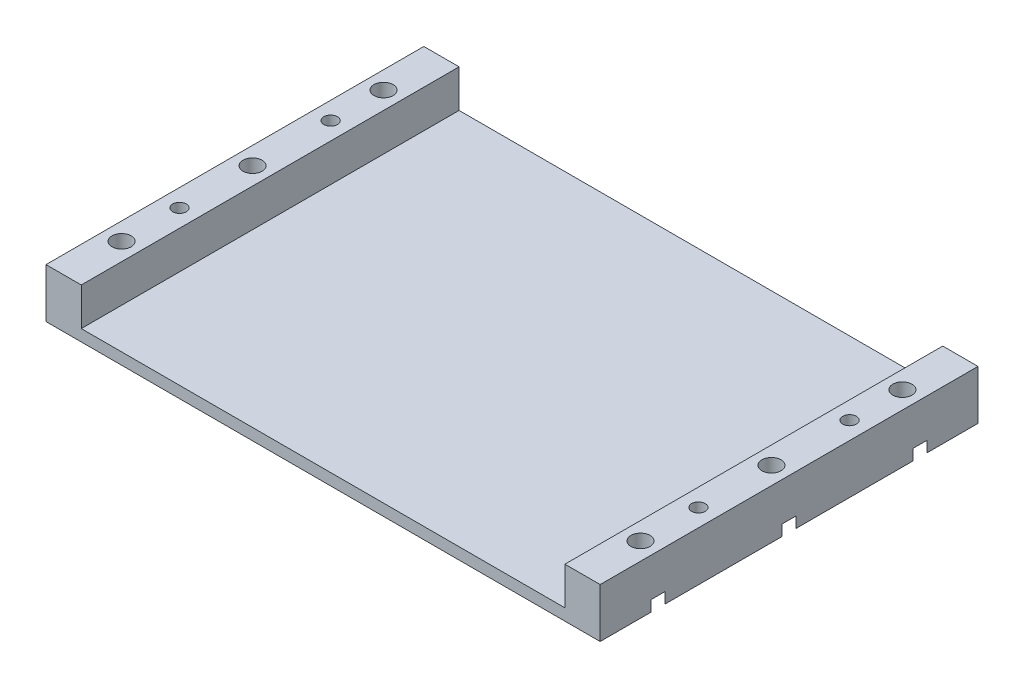
ISO-10303-21;
HEADER;
FILE_DESCRIPTION(('STEP AP214'),'2;1');
FILE_NAME('part.step','',(''),(''),'','','');
FILE_SCHEMA(('AUTOMOTIVE_DESIGN { 1 0 10303 214 1 1 1 1 }'));
ENDSEC;
DATA;
#1=APPLICATION_CONTEXT('core data for automotive mechanical design processes');
#2=APPLICATION_PROTOCOL_DEFINITION('international standard','automotive_design',2000,#1);
#3=PRODUCT_CONTEXT('',#1,'mechanical');
#4=PRODUCT('Part','Part','',(#3));
#5=PRODUCT_RELATED_PRODUCT_CATEGORY('part','',(#4));
#6=PRODUCT_DEFINITION_FORMATION('','',#4);
#7=PRODUCT_DEFINITION_CONTEXT('part definition',#1,'design');
#8=PRODUCT_DEFINITION('design','',#6,#7);
#9=PRODUCT_DEFINITION_SHAPE('','',#8);
#10=(LENGTH_UNIT() NAMED_UNIT(*) SI_UNIT(.MILLI.,.METRE.));
#11=(NAMED_UNIT(*) PLANE_ANGLE_UNIT() SI_UNIT($,.RADIAN.));
#12=(NAMED_UNIT(*) SI_UNIT($,.STERADIAN.) SOLID_ANGLE_UNIT());
#13=UNCERTAINTY_MEASURE_WITH_UNIT(LENGTH_MEASURE(1.E-05),#10,'distance_accuracy_value','');
#14=(GEOMETRIC_REPRESENTATION_CONTEXT(3) GLOBAL_UNCERTAINTY_ASSIGNED_CONTEXT((#13)) GLOBAL_UNIT_ASSIGNED_CONTEXT((#10,
#11,#12)) REPRESENTATION_CONTEXT('',''));
#15=CARTESIAN_POINT('',(0.,0.,0.));
#16=DIRECTION('',(0.,0.,1.));
#17=DIRECTION('',(1.,0.,0.));
#18=AXIS2_PLACEMENT_3D('',#15,#16,#17);
#19=CARTESIAN_POINT('',(0.,2.3,0.));
#20=DIRECTION('',(0.,0.,-1.));
#21=DIRECTION('',(-1.,0.,0.));
#22=AXIS2_PLACEMENT_3D('',#19,#20,#21);
#23=PLANE('',#22);
#24=DIRECTION('',(1.,0.,0.));
#25=VECTOR('',#24,1.);
#26=CARTESIAN_POINT('',(0.,0.,0.));
#27=LINE('',#26,#25);
#28=CARTESIAN_POINT('',(-6.99999999999999,0.,0.));
#29=VERTEX_POINT('',#28);
#30=CARTESIAN_POINT('',(103.,0.,0.));
#31=VERTEX_POINT('',#30);
#32=EDGE_CURVE('E382',#29,#31,#27,.T.);
#33=ORIENTED_EDGE('',*,*,#32,.T.);
#34=DIRECTION('',(0.,-1.,0.));
#35=VECTOR('',#34,1.);
#36=CARTESIAN_POINT('',(103.,85.1259583410659,0.));
#37=LINE('',#36,#35);
#38=CARTESIAN_POINT('',(103.,9.8,0.));
#39=VERTEX_POINT('',#38);
#40=EDGE_CURVE('E456',#39,#31,#37,.T.);
#41=ORIENTED_EDGE('',*,*,#40,.F.);
#42=DIRECTION('',(-1.,0.,0.));
#43=VECTOR('',#42,1.);
#44=CARTESIAN_POINT('',(96.,9.8,0.));
#45=LINE('',#44,#43);
#46=CARTESIAN_POINT('',(96.,9.8,0.));
#47=VERTEX_POINT('',#46);
#48=EDGE_CURVE('E464',#39,#47,#45,.T.);
#49=ORIENTED_EDGE('',*,*,#48,.T.);
#50=DIRECTION('',(0.,-1.,0.));
#51=VECTOR('',#50,1.);
#52=CARTESIAN_POINT('',(96.,85.1259583410659,0.));
#53=LINE('',#52,#51);
#54=CARTESIAN_POINT('',(96.,2.3,0.));
#55=VERTEX_POINT('',#54);
#56=EDGE_CURVE('E448',#47,#55,#53,.T.);
#57=ORIENTED_EDGE('',*,*,#56,.T.);
#58=DIRECTION('',(1.,0.,0.));
#59=VECTOR('',#58,1.);
#60=CARTESIAN_POINT('',(0.,2.3,0.));
#61=LINE('',#60,#59);
#62=CARTESIAN_POINT('',(0.,2.3,0.));
#63=VERTEX_POINT('',#62);
#64=EDGE_CURVE('E371',#63,#55,#61,.T.);
#65=ORIENTED_EDGE('',*,*,#64,.F.);
#66=DIRECTION('',(0.,1.,0.));
#67=VECTOR('',#66,1.);
#68=CARTESIAN_POINT('',(0.,-75.325958341066,0.));
#69=LINE('',#68,#67);
#70=CARTESIAN_POINT('',(0.,9.8,0.));
#71=VERTEX_POINT('',#70);
#72=EDGE_CURVE('E377',#63,#71,#69,.T.);
#73=ORIENTED_EDGE('',*,*,#72,.T.);
#74=DIRECTION('',(1.,0.,0.));
#75=VECTOR('',#74,1.);
#76=CARTESIAN_POINT('',(0.,9.8,0.));
#77=LINE('',#76,#75);
#78=CARTESIAN_POINT('',(-6.99999999999999,9.8,0.));
#79=VERTEX_POINT('',#78);
#80=EDGE_CURVE('E427',#79,#71,#77,.T.);
#81=ORIENTED_EDGE('',*,*,#80,.F.);
#82=DIRECTION('',(0.,1.,0.));
#83=VECTOR('',#82,1.);
#84=CARTESIAN_POINT('',(-6.99999999999999,-75.325958341066,0.));
#85=LINE('',#84,#83);
#86=EDGE_CURVE('E413',#29,#79,#85,.T.);
#87=ORIENTED_EDGE('',*,*,#86,.F.);
#88=EDGE_LOOP('',(#33,#41,#49,#57,#65,#73,#81,#87));
#89=FACE_BOUND('',#88,.T.);
#90=ADVANCED_FACE('F130',(#89),#23,.F.);
#91=CARTESIAN_POINT('',(0.,2.3,-75.));
#92=DIRECTION('',(0.,0.,-1.));
#93=DIRECTION('',(-1.,0.,0.));
#94=AXIS2_PLACEMENT_3D('',#91,#92,#93);
#95=PLANE('',#94);
#96=DIRECTION('',(1.,0.,0.));
#97=VECTOR('',#96,1.);
#98=CARTESIAN_POINT('',(0.,0.,-75.));
#99=LINE('',#98,#97);
#100=CARTESIAN_POINT('',(-7.,0.,-75.));
#101=VERTEX_POINT('',#100);
#102=CARTESIAN_POINT('',(103.,0.,-75.));
#103=VERTEX_POINT('',#102);
#104=EDGE_CURVE('E387',#101,#103,#99,.T.);
#105=ORIENTED_EDGE('',*,*,#104,.F.);
#106=DIRECTION('',(0.,1.,0.));
#107=VECTOR('',#106,1.);
#108=CARTESIAN_POINT('',(-7.,-75.325958341066,-75.));
#109=LINE('',#108,#107);
#110=CARTESIAN_POINT('',(-7.,9.8,-75.));
#111=VERTEX_POINT('',#110);
#112=EDGE_CURVE('E417',#101,#111,#109,.T.);
#113=ORIENTED_EDGE('',*,*,#112,.T.);
#114=DIRECTION('',(-1.,0.,0.));
#115=VECTOR('',#114,1.);
#116=CARTESIAN_POINT('',(0.,9.8,-75.));
#117=LINE('',#116,#115);
#118=CARTESIAN_POINT('',(0.,9.8,-75.));
#119=VERTEX_POINT('',#118);
#120=EDGE_CURVE('E435',#119,#111,#117,.T.);
#121=ORIENTED_EDGE('',*,*,#120,.F.);
#122=DIRECTION('',(0.,1.,0.));
#123=VECTOR('',#122,1.);
#124=CARTESIAN_POINT('',(0.,-75.325958341066,-75.));
#125=LINE('',#124,#123);
#126=CARTESIAN_POINT('',(0.,2.3,-75.));
#127=VERTEX_POINT('',#126);
#128=EDGE_CURVE('E422',#127,#119,#125,.T.);
#129=ORIENTED_EDGE('',*,*,#128,.F.);
#130=DIRECTION('',(1.,0.,0.));
#131=VECTOR('',#130,1.);
#132=CARTESIAN_POINT('',(0.,2.3,-75.));
#133=LINE('',#132,#131);
#134=CARTESIAN_POINT('',(96.,2.3,-75.));
#135=VERTEX_POINT('',#134);
#136=EDGE_CURVE('E370',#127,#135,#133,.T.);
#137=ORIENTED_EDGE('',*,*,#136,.T.);
#138=DIRECTION('',(0.,-1.,0.));
#139=VECTOR('',#138,1.);
#140=CARTESIAN_POINT('',(96.,85.1259583410659,-75.));
#141=LINE('',#140,#139);
#142=CARTESIAN_POINT('',(96.,9.8,-75.));
#143=VERTEX_POINT('',#142);
#144=EDGE_CURVE('E443',#143,#135,#141,.T.);
#145=ORIENTED_EDGE('',*,*,#144,.F.);
#146=DIRECTION('',(1.,0.,0.));
#147=VECTOR('',#146,1.);
#148=CARTESIAN_POINT('',(96.,9.8,-75.));
#149=LINE('',#148,#147);
#150=CARTESIAN_POINT('',(103.,9.8,-75.));
#151=VERTEX_POINT('',#150);
#152=EDGE_CURVE('E458',#143,#151,#149,.T.);
#153=ORIENTED_EDGE('',*,*,#152,.T.);
#154=DIRECTION('',(0.,-1.,0.));
#155=VECTOR('',#154,1.);
#156=CARTESIAN_POINT('',(103.,85.1259583410659,-75.));
#157=LINE('',#156,#155);
#158=EDGE_CURVE('E446',#151,#103,#157,.T.);
#159=ORIENTED_EDGE('',*,*,#158,.T.);
#160=EDGE_LOOP('',(#105,#113,#121,#129,#137,#145,#153,#159));
#161=FACE_BOUND('',#160,.T.);
#162=ADVANCED_FACE('F473',(#161),#95,.T.);
#163=CARTESIAN_POINT('',(0.,2.3,0.));
#164=DIRECTION('',(0.,1.,0.));
#165=DIRECTION('',(0.,0.,1.));
#166=AXIS2_PLACEMENT_3D('',#163,#164,#165);
#167=PLANE('',#166);
#168=ORIENTED_EDGE('',*,*,#64,.T.);
#169=DIRECTION('',(0.,0.,-1.));
#170=VECTOR('',#169,1.);
#171=CARTESIAN_POINT('',(96.,2.3,0.));
#172=LINE('',#171,#170);
#173=EDGE_CURVE('E366',#55,#135,#172,.T.);
#174=ORIENTED_EDGE('',*,*,#173,.T.);
#175=ORIENTED_EDGE('',*,*,#136,.F.);
#176=DIRECTION('',(0.,0.,-1.));
#177=VECTOR('',#176,1.);
#178=CARTESIAN_POINT('',(0.,2.3,0.));
#179=LINE('',#178,#177);
#180=EDGE_CURVE('E340',#63,#127,#179,.T.);
#181=ORIENTED_EDGE('',*,*,#180,.F.);
#182=EDGE_LOOP('',(#168,#174,#175,#181));
#183=FACE_BOUND('',#182,.T.);
#184=ADVANCED_FACE('F472',(#183),#167,.T.);
#185=CARTESIAN_POINT('',(0.,0.,0.));
#186=DIRECTION('',(0.,1.,0.));
#187=DIRECTION('',(0.,0.,1.));
#188=AXIS2_PLACEMENT_3D('',#185,#186,#187);
#189=PLANE('',#188);
#190=CARTESIAN_POINT('',(99.5,0.,-23.));
#191=DIRECTION('',(0.,-1.,0.));
#192=DIRECTION('',(0.,0.,-1.));
#193=AXIS2_PLACEMENT_3D('',#190,#191,#192);
#194=CIRCLE('',#193,1.75259999999999);
#195=CARTESIAN_POINT('',(99.5,0.,-24.7526));
#196=VERTEX_POINT('',#195);
#197=EDGE_CURVE('E344',#196,#196,#194,.T.);
#198=ORIENTED_EDGE('',*,*,#197,.F.);
#199=EDGE_LOOP('',(#198));
#200=FACE_BOUND('',#199,.T.);
#201=CARTESIAN_POINT('',(99.5,0.,-53.));
#202=DIRECTION('',(0.,-1.,0.));
#203=DIRECTION('',(0.,0.,-1.));
#204=AXIS2_PLACEMENT_3D('',#201,#202,#203);
#205=CIRCLE('',#204,1.75259999999999);
#206=CARTESIAN_POINT('',(99.5,0.,-54.7526));
#207=VERTEX_POINT('',#206);
#208=EDGE_CURVE('E349',#207,#207,#205,.T.);
#209=ORIENTED_EDGE('',*,*,#208,.F.);
#210=EDGE_LOOP('',(#209));
#211=FACE_BOUND('',#210,.T.);
#212=CARTESIAN_POINT('',(-3.49999999999999,0.,-23.));
#213=DIRECTION('',(0.,-1.,0.));
#214=DIRECTION('',(0.,0.,-1.));
#215=AXIS2_PLACEMENT_3D('',#212,#213,#214);
#216=CIRCLE('',#215,1.7526);
#217=CARTESIAN_POINT('',(-3.49999999999999,0.,-24.7526));
#218=VERTEX_POINT('',#217);
#219=EDGE_CURVE('E354',#218,#218,#216,.T.);
#220=ORIENTED_EDGE('',*,*,#219,.F.);
#221=EDGE_LOOP('',(#220));
#222=FACE_BOUND('',#221,.T.);
#223=CARTESIAN_POINT('',(-3.49999999999999,0.,-53.));
#224=DIRECTION('',(0.,-1.,0.));
#225=DIRECTION('',(0.,0.,-1.));
#226=AXIS2_PLACEMENT_3D('',#223,#224,#225);
#227=CIRCLE('',#226,1.7526);
#228=CARTESIAN_POINT('',(-3.49999999999999,0.,-54.7526));
#229=VERTEX_POINT('',#228);
#230=EDGE_CURVE('E359',#229,#229,#227,.T.);
#231=ORIENTED_EDGE('',*,*,#230,.F.);
#232=EDGE_LOOP('',(#231));
#233=FACE_BOUND('',#232,.T.);
#234=DIRECTION('',(0.,0.,1.));
#235=VECTOR('',#234,1.);
#236=CARTESIAN_POINT('',(103.,0.,-75.));
#237=LINE('',#236,#235);
#238=CARTESIAN_POINT('',(103.,0.,-64.9027296948807));
#239=VERTEX_POINT('',#238);
#240=EDGE_CURVE('E447',#103,#239,#237,.T.);
#241=ORIENTED_EDGE('',*,*,#240,.T.);
#242=CARTESIAN_POINT('',(99.5,0.,-63.5));
#243=DIRECTION('',(0.,-1.,0.));
#244=DIRECTION('',(0.,0.,-1.));
#245=AXIS2_PLACEMENT_3D('',#242,#243,#244);
#246=CIRCLE('',#245,3.77063);
#247=CARTESIAN_POINT('',(103.,0.,-62.0972703051194));
#248=VERTEX_POINT('',#247);
#249=EDGE_CURVE('E265',#248,#239,#246,.T.);
#250=ORIENTED_EDGE('',*,*,#249,.F.);
#251=CARTESIAN_POINT('',(103.,0.,-38.9027296948807));
#252=VERTEX_POINT('',#251);
#253=EDGE_CURVE('E860',#248,#252,#237,.T.);
#254=ORIENTED_EDGE('',*,*,#253,.T.);
#255=CARTESIAN_POINT('',(99.5,0.,-37.5));
#256=DIRECTION('',(0.,-1.,0.));
#257=DIRECTION('',(0.,0.,-1.));
#258=AXIS2_PLACEMENT_3D('',#255,#256,#257);
#259=CIRCLE('',#258,3.77063);
#260=CARTESIAN_POINT('',(103.,0.,-36.0972703051194));
#261=VERTEX_POINT('',#260);
#262=EDGE_CURVE('E284',#261,#252,#259,.T.);
#263=ORIENTED_EDGE('',*,*,#262,.F.);
#264=CARTESIAN_POINT('',(103.,0.,-12.9027296948806));
#265=VERTEX_POINT('',#264);
#266=EDGE_CURVE('E861',#261,#265,#237,.T.);
#267=ORIENTED_EDGE('',*,*,#266,.T.);
#268=CARTESIAN_POINT('',(99.5,0.,-11.5));
#269=DIRECTION('',(0.,-1.,0.));
#270=DIRECTION('',(0.,0.,-1.));
#271=AXIS2_PLACEMENT_3D('',#268,#269,#270);
#272=CIRCLE('',#271,3.77063);
#273=CARTESIAN_POINT('',(103.,0.,-10.0972703051194));
#274=VERTEX_POINT('',#273);
#275=EDGE_CURVE('E297',#274,#265,#272,.T.);
#276=ORIENTED_EDGE('',*,*,#275,.F.);
#277=EDGE_CURVE('E364',#274,#31,#237,.T.);
#278=ORIENTED_EDGE('',*,*,#277,.T.);
#279=ORIENTED_EDGE('',*,*,#32,.F.);
#280=DIRECTION('',(0.,0.,-1.));
#281=VECTOR('',#280,1.);
#282=CARTESIAN_POINT('',(-7.,0.,-75.));
#283=LINE('',#282,#281);
#284=CARTESIAN_POINT('',(-6.99999999999999,0.,-10.0972703051194));
#285=VERTEX_POINT('',#284);
#286=EDGE_CURVE('E398',#29,#285,#283,.T.);
#287=ORIENTED_EDGE('',*,*,#286,.T.);
#288=CARTESIAN_POINT('',(-3.49999999999999,0.,-11.5));
#289=DIRECTION('',(0.,-1.,0.));
#290=DIRECTION('',(0.,0.,-1.));
#291=AXIS2_PLACEMENT_3D('',#288,#289,#290);
#292=CIRCLE('',#291,3.77063);
#293=CARTESIAN_POINT('',(-6.99999999999999,0.,-12.9027296948807));
#294=VERTEX_POINT('',#293);
#295=EDGE_CURVE('E311',#294,#285,#292,.T.);
#296=ORIENTED_EDGE('',*,*,#295,.F.);
#297=CARTESIAN_POINT('',(-6.99999999999999,0.,-36.0972703051194));
#298=VERTEX_POINT('',#297);
#299=EDGE_CURVE('E404',#294,#298,#283,.T.);
#300=ORIENTED_EDGE('',*,*,#299,.T.);
#301=CARTESIAN_POINT('',(-3.49999999999998,0.,-37.5));
#302=DIRECTION('',(0.,-1.,0.));
#303=DIRECTION('',(0.,0.,-1.));
#304=AXIS2_PLACEMENT_3D('',#301,#302,#303);
#305=CIRCLE('',#304,3.77063);
#306=CARTESIAN_POINT('',(-6.99999999999999,0.,-38.9027296948807));
#307=VERTEX_POINT('',#306);
#308=EDGE_CURVE('E322',#307,#298,#305,.T.);
#309=ORIENTED_EDGE('',*,*,#308,.F.);
#310=CARTESIAN_POINT('',(-7.,0.,-62.0972703051194));
#311=VERTEX_POINT('',#310);
#312=EDGE_CURVE('E409',#307,#311,#283,.T.);
#313=ORIENTED_EDGE('',*,*,#312,.T.);
#314=CARTESIAN_POINT('',(-3.49999999999999,0.,-63.5));
#315=DIRECTION('',(0.,-1.,0.));
#316=DIRECTION('',(0.,0.,-1.));
#317=AXIS2_PLACEMENT_3D('',#314,#315,#316);
#318=CIRCLE('',#317,3.77063);
#319=CARTESIAN_POINT('',(-7.,0.,-64.9027296948807));
#320=VERTEX_POINT('',#319);
#321=EDGE_CURVE('E333',#320,#311,#318,.T.);
#322=ORIENTED_EDGE('',*,*,#321,.F.);
#323=EDGE_CURVE('E406',#320,#101,#283,.T.);
#324=ORIENTED_EDGE('',*,*,#323,.T.);
#325=ORIENTED_EDGE('',*,*,#104,.T.);
#326=EDGE_LOOP('',(#241,#250,#254,#263,#267,#276,#278,#279,#287,#296,#300,#309,#313,#322,#324,#325));
#327=FACE_BOUND('',#326,.T.);
#328=ADVANCED_FACE('F479',(#200,#211,#222,#233,#327),#189,.F.);
#329=CARTESIAN_POINT('',(0.,-75.325958341066,-75.));
#330=DIRECTION('',(1.,0.,0.));
#331=DIRECTION('',(0.,0.,-1.));
#332=AXIS2_PLACEMENT_3D('',#329,#330,#331);
#333=PLANE('',#332);
#334=ORIENTED_EDGE('',*,*,#72,.F.);
#335=ORIENTED_EDGE('',*,*,#180,.T.);
#336=ORIENTED_EDGE('',*,*,#128,.T.);
#337=DIRECTION('',(0.,0.,-1.));
#338=VECTOR('',#337,1.);
#339=CARTESIAN_POINT('',(0.,9.8,-75.));
#340=LINE('',#339,#338);
#341=EDGE_CURVE('E440',#71,#119,#340,.T.);
#342=ORIENTED_EDGE('',*,*,#341,.F.);
#343=EDGE_LOOP('',(#334,#335,#336,#342));
#344=FACE_BOUND('',#343,.T.);
#345=ADVANCED_FACE('F476',(#344),#333,.T.);
#346=CARTESIAN_POINT('',(-7.,-75.325958341066,-75.));
#347=DIRECTION('',(-1.,0.,0.));
#348=DIRECTION('',(0.,0.,1.));
#349=AXIS2_PLACEMENT_3D('',#346,#347,#348);
#350=PLANE('',#349);
#351=DIRECTION('',(0.,-1.,0.));
#352=VECTOR('',#351,1.);
#353=CARTESIAN_POINT('',(-6.99999999999999,0.,-12.9027296948807));
#354=LINE('',#353,#352);
#355=CARTESIAN_POINT('',(-6.99999999999999,2.1541994,-12.9027296948807));
#356=VERTEX_POINT('',#355);
#357=EDGE_CURVE('E307',#356,#294,#354,.T.);
#358=ORIENTED_EDGE('',*,*,#357,.F.);
#359=DIRECTION('',(0.,0.,-1.));
#360=VECTOR('',#359,1.);
#361=CARTESIAN_POINT('',(-7.,2.1541994,-75.));
#362=LINE('',#361,#360);
#363=CARTESIAN_POINT('',(-6.99999999999999,2.1541994,-10.0972703051194));
#364=VERTEX_POINT('',#363);
#365=EDGE_CURVE('E314',#364,#356,#362,.T.);
#366=ORIENTED_EDGE('',*,*,#365,.F.);
#367=DIRECTION('',(0.,-1.,0.));
#368=VECTOR('',#367,1.);
#369=CARTESIAN_POINT('',(-6.99999999999999,0.,-10.0972703051194));
#370=LINE('',#369,#368);
#371=EDGE_CURVE('E316',#285,#364,#370,.F.);
#372=ORIENTED_EDGE('',*,*,#371,.F.);
#373=ORIENTED_EDGE('',*,*,#286,.F.);
#374=ORIENTED_EDGE('',*,*,#86,.T.);
#375=DIRECTION('',(0.,0.,1.));
#376=VECTOR('',#375,1.);
#377=CARTESIAN_POINT('',(-7.,9.8,-75.));
#378=LINE('',#377,#376);
#379=EDGE_CURVE('E432',#111,#79,#378,.T.);
#380=ORIENTED_EDGE('',*,*,#379,.F.);
#381=ORIENTED_EDGE('',*,*,#112,.F.);
#382=ORIENTED_EDGE('',*,*,#323,.F.);
#383=DIRECTION('',(0.,-1.,0.));
#384=VECTOR('',#383,1.);
#385=CARTESIAN_POINT('',(-7.,0.,-64.9027296948807));
#386=LINE('',#385,#384);
#387=CARTESIAN_POINT('',(-7.,2.1541994,-64.9027296948807));
#388=VERTEX_POINT('',#387);
#389=EDGE_CURVE('E329',#388,#320,#386,.T.);
#390=ORIENTED_EDGE('',*,*,#389,.F.);
#391=DIRECTION('',(0.,0.,-1.));
#392=VECTOR('',#391,1.);
#393=CARTESIAN_POINT('',(-7.,2.1541994,-75.));
#394=LINE('',#393,#392);
#395=CARTESIAN_POINT('',(-7.,2.1541994,-62.0972703051194));
#396=VERTEX_POINT('',#395);
#397=EDGE_CURVE('E336',#396,#388,#394,.T.);
#398=ORIENTED_EDGE('',*,*,#397,.F.);
#399=DIRECTION('',(0.,-1.,0.));
#400=VECTOR('',#399,1.);
#401=CARTESIAN_POINT('',(-7.,0.,-62.0972703051194));
#402=LINE('',#401,#400);
#403=EDGE_CURVE('E338',#311,#396,#402,.F.);
#404=ORIENTED_EDGE('',*,*,#403,.F.);
#405=ORIENTED_EDGE('',*,*,#312,.F.);
#406=DIRECTION('',(0.,-1.,0.));
#407=VECTOR('',#406,1.);
#408=CARTESIAN_POINT('',(-6.99999999999999,0.,-38.9027296948807));
#409=LINE('',#408,#407);
#410=CARTESIAN_POINT('',(-6.99999999999999,2.1541994,-38.9027296948807));
#411=VERTEX_POINT('',#410);
#412=EDGE_CURVE('E318',#411,#307,#409,.T.);
#413=ORIENTED_EDGE('',*,*,#412,.F.);
#414=DIRECTION('',(0.,0.,-1.));
#415=VECTOR('',#414,1.);
#416=CARTESIAN_POINT('',(-7.,2.1541994,-75.));
#417=LINE('',#416,#415);
#418=CARTESIAN_POINT('',(-6.99999999999999,2.1541994,-36.0972703051194));
#419=VERTEX_POINT('',#418);
#420=EDGE_CURVE('E325',#419,#411,#417,.T.);
#421=ORIENTED_EDGE('',*,*,#420,.F.);
#422=DIRECTION('',(0.,-1.,0.));
#423=VECTOR('',#422,1.);
#424=CARTESIAN_POINT('',(-6.99999999999999,0.,-36.0972703051194));
#425=LINE('',#424,#423);
#426=EDGE_CURVE('E327',#298,#419,#425,.F.);
#427=ORIENTED_EDGE('',*,*,#426,.F.);
#428=ORIENTED_EDGE('',*,*,#299,.F.);
#429=EDGE_LOOP('',(#358,#366,#372,#373,#374,#380,#381,#382,#390,#398,#404,#405,#413,#421,#427,#428));
#430=FACE_BOUND('',#429,.T.);
#431=ADVANCED_FACE('F478',(#430),#350,.T.);
#432=CARTESIAN_POINT('',(0.,9.8,0.));
#433=DIRECTION('',(0.,-1.,0.));
#434=DIRECTION('',(0.,0.,-1.));
#435=AXIS2_PLACEMENT_3D('',#432,#433,#434);
#436=PLANE('',#435);
#437=CARTESIAN_POINT('',(-3.49999999999999,9.8,-11.5));
#438=DIRECTION('',(0.,-1.,0.));
#439=DIRECTION('',(0.,0.,-1.));
#440=AXIS2_PLACEMENT_3D('',#437,#438,#439);
#441=CIRCLE('',#440,1.89865);
#442=CARTESIAN_POINT('',(-3.49999999999999,9.8,-13.39865));
#443=VERTEX_POINT('',#442);
#444=EDGE_CURVE('E319',#443,#443,#441,.T.);
#445=ORIENTED_EDGE('',*,*,#444,.T.);
#446=EDGE_LOOP('',(#445));
#447=FACE_BOUND('',#446,.T.);
#448=CARTESIAN_POINT('',(-3.49999999999998,9.8,-37.5));
#449=DIRECTION('',(0.,-1.,0.));
#450=DIRECTION('',(0.,0.,-1.));
#451=AXIS2_PLACEMENT_3D('',#448,#449,#450);
#452=CIRCLE('',#451,1.89865);
#453=CARTESIAN_POINT('',(-3.49999999999998,9.8,-39.39865));
#454=VERTEX_POINT('',#453);
#455=EDGE_CURVE('E330',#454,#454,#452,.T.);
#456=ORIENTED_EDGE('',*,*,#455,.T.);
#457=EDGE_LOOP('',(#456));
#458=FACE_BOUND('',#457,.T.);
#459=CARTESIAN_POINT('',(-3.49999999999999,9.8,-63.5));
#460=DIRECTION('',(0.,-1.,0.));
#461=DIRECTION('',(0.,0.,-1.));
#462=AXIS2_PLACEMENT_3D('',#459,#460,#461);
#463=CIRCLE('',#462,1.89865);
#464=CARTESIAN_POINT('',(-3.49999999999999,9.8,-65.39865));
#465=VERTEX_POINT('',#464);
#466=EDGE_CURVE('E341',#465,#465,#463,.T.);
#467=ORIENTED_EDGE('',*,*,#466,.T.);
#468=EDGE_LOOP('',(#467));
#469=FACE_BOUND('',#468,.T.);
#470=CARTESIAN_POINT('',(-3.49999999999999,9.8,-23.));
#471=DIRECTION('',(0.,-1.,0.));
#472=DIRECTION('',(0.,0.,-1.));
#473=AXIS2_PLACEMENT_3D('',#470,#471,#472);
#474=CIRCLE('',#473,1.35255);
#475=CARTESIAN_POINT('',(-3.49999999999999,9.8,-24.35255));
#476=VERTEX_POINT('',#475);
#477=EDGE_CURVE('E356',#476,#476,#474,.T.);
#478=ORIENTED_EDGE('',*,*,#477,.T.);
#479=EDGE_LOOP('',(#478));
#480=FACE_BOUND('',#479,.T.);
#481=CARTESIAN_POINT('',(-3.49999999999999,9.8,-53.));
#482=DIRECTION('',(0.,-1.,0.));
#483=DIRECTION('',(0.,0.,-1.));
#484=AXIS2_PLACEMENT_3D('',#481,#482,#483);
#485=CIRCLE('',#484,1.35255);
#486=CARTESIAN_POINT('',(-3.49999999999999,9.8,-54.35255));
#487=VERTEX_POINT('',#486);
#488=EDGE_CURVE('E361',#487,#487,#485,.T.);
#489=ORIENTED_EDGE('',*,*,#488,.T.);
#490=EDGE_LOOP('',(#489));
#491=FACE_BOUND('',#490,.T.);
#492=ORIENTED_EDGE('',*,*,#341,.T.);
#493=ORIENTED_EDGE('',*,*,#120,.T.);
#494=ORIENTED_EDGE('',*,*,#379,.T.);
#495=ORIENTED_EDGE('',*,*,#80,.T.);
#496=EDGE_LOOP('',(#492,#493,#494,#495));
#497=FACE_BOUND('',#496,.T.);
#498=ADVANCED_FACE('F475',(#447,#458,#469,#480,#491,#497),#436,.F.);
#499=CARTESIAN_POINT('',(103.,85.1259583410659,-75.));
#500=DIRECTION('',(-1.,0.,0.));
#501=DIRECTION('',(0.,0.,1.));
#502=AXIS2_PLACEMENT_3D('',#499,#500,#501);
#503=PLANE('',#502);
#504=DIRECTION('',(0.,0.,-1.));
#505=VECTOR('',#504,1.);
#506=CARTESIAN_POINT('',(103.,2.1541994,-75.));
#507=LINE('',#506,#505);
#508=CARTESIAN_POINT('',(103.,2.1541994,-62.0972703051194));
#509=VERTEX_POINT('',#508);
#510=CARTESIAN_POINT('',(103.,2.1541994,-64.9027296948807));
#511=VERTEX_POINT('',#510);
#512=EDGE_CURVE('E137',#509,#511,#507,.T.);
#513=ORIENTED_EDGE('',*,*,#512,.T.);
#514=DIRECTION('',(0.,-1.,0.));
#515=VECTOR('',#514,1.);
#516=CARTESIAN_POINT('',(103.,0.,-64.9027296948807));
#517=LINE('',#516,#515);
#518=EDGE_CURVE('E12',#511,#239,#517,.T.);
#519=ORIENTED_EDGE('',*,*,#518,.T.);
#520=ORIENTED_EDGE('',*,*,#240,.F.);
#521=ORIENTED_EDGE('',*,*,#158,.F.);
#522=DIRECTION('',(0.,0.,1.));
#523=VECTOR('',#522,1.);
#524=CARTESIAN_POINT('',(103.,9.8,-75.));
#525=LINE('',#524,#523);
#526=EDGE_CURVE('E460',#151,#39,#525,.T.);
#527=ORIENTED_EDGE('',*,*,#526,.T.);
#528=ORIENTED_EDGE('',*,*,#40,.T.);
#529=ORIENTED_EDGE('',*,*,#277,.F.);
#530=DIRECTION('',(0.,-1.,0.));
#531=VECTOR('',#530,1.);
#532=CARTESIAN_POINT('',(103.,0.,-10.0972703051194));
#533=LINE('',#532,#531);
#534=CARTESIAN_POINT('',(103.,2.1541994,-10.0972703051194));
#535=VERTEX_POINT('',#534);
#536=EDGE_CURVE('E304',#274,#535,#533,.F.);
#537=ORIENTED_EDGE('',*,*,#536,.T.);
#538=DIRECTION('',(0.,0.,-1.));
#539=VECTOR('',#538,1.);
#540=CARTESIAN_POINT('',(103.,2.1541994,-75.));
#541=LINE('',#540,#539);
#542=CARTESIAN_POINT('',(103.,2.1541994,-12.9027296948806));
#543=VERTEX_POINT('',#542);
#544=EDGE_CURVE('E301',#535,#543,#541,.T.);
#545=ORIENTED_EDGE('',*,*,#544,.T.);
#546=DIRECTION('',(0.,-1.,0.));
#547=VECTOR('',#546,1.);
#548=CARTESIAN_POINT('',(103.,0.,-12.9027296948806));
#549=LINE('',#548,#547);
#550=EDGE_CURVE('E293',#543,#265,#549,.T.);
#551=ORIENTED_EDGE('',*,*,#550,.T.);
#552=ORIENTED_EDGE('',*,*,#266,.F.);
#553=DIRECTION('',(0.,-1.,0.));
#554=VECTOR('',#553,1.);
#555=CARTESIAN_POINT('',(103.,0.,-36.0972703051194));
#556=LINE('',#555,#554);
#557=CARTESIAN_POINT('',(103.,2.1541994,-36.0972703051194));
#558=VERTEX_POINT('',#557);
#559=EDGE_CURVE('E290',#261,#558,#556,.F.);
#560=ORIENTED_EDGE('',*,*,#559,.T.);
#561=DIRECTION('',(0.,0.,-1.));
#562=VECTOR('',#561,1.);
#563=CARTESIAN_POINT('',(103.,2.1541994,-75.));
#564=LINE('',#563,#562);
#565=CARTESIAN_POINT('',(103.,2.1541994,-38.9027296948807));
#566=VERTEX_POINT('',#565);
#567=EDGE_CURVE('E287',#558,#566,#564,.T.);
#568=ORIENTED_EDGE('',*,*,#567,.T.);
#569=DIRECTION('',(0.,-1.,0.));
#570=VECTOR('',#569,1.);
#571=CARTESIAN_POINT('',(103.,0.,-38.9027296948807));
#572=LINE('',#571,#570);
#573=EDGE_CURVE('E278',#566,#252,#572,.T.);
#574=ORIENTED_EDGE('',*,*,#573,.T.);
#575=ORIENTED_EDGE('',*,*,#253,.F.);
#576=DIRECTION('',(0.,-1.,0.));
#577=VECTOR('',#576,1.);
#578=CARTESIAN_POINT('',(103.,0.,-62.0972703051194));
#579=LINE('',#578,#577);
#580=EDGE_CURVE('E277',#248,#509,#579,.F.);
#581=ORIENTED_EDGE('',*,*,#580,.T.);
#582=EDGE_LOOP('',(#513,#519,#520,#521,#527,#528,#529,#537,#545,#551,#552,#560,#568,#574,#575,#581));
#583=FACE_BOUND('',#582,.T.);
#584=ADVANCED_FACE('F275',(#583),#503,.F.);
#585=CARTESIAN_POINT('',(96.,85.1259583410659,-75.));
#586=DIRECTION('',(1.,0.,0.));
#587=DIRECTION('',(0.,0.,-1.));
#588=AXIS2_PLACEMENT_3D('',#585,#586,#587);
#589=PLANE('',#588);
#590=ORIENTED_EDGE('',*,*,#173,.F.);
#591=ORIENTED_EDGE('',*,*,#56,.F.);
#592=DIRECTION('',(0.,0.,-1.));
#593=VECTOR('',#592,1.);
#594=CARTESIAN_POINT('',(96.,9.8,-75.));
#595=LINE('',#594,#593);
#596=EDGE_CURVE('E442',#47,#143,#595,.T.);
#597=ORIENTED_EDGE('',*,*,#596,.T.);
#598=ORIENTED_EDGE('',*,*,#144,.T.);
#599=EDGE_LOOP('',(#590,#591,#597,#598));
#600=FACE_BOUND('',#599,.T.);
#601=ADVANCED_FACE('F471',(#600),#589,.F.);
#602=CARTESIAN_POINT('',(0.,9.8,0.));
#603=DIRECTION('',(0.,-1.,0.));
#604=DIRECTION('',(0.,0.,-1.));
#605=AXIS2_PLACEMENT_3D('',#602,#603,#604);
#606=PLANE('',#605);
#607=CARTESIAN_POINT('',(99.5,9.8,-63.5));
#608=DIRECTION('',(0.,-1.,0.));
#609=DIRECTION('',(0.,0.,-1.));
#610=AXIS2_PLACEMENT_3D('',#607,#608,#609);
#611=CIRCLE('',#610,1.89865);
#612=CARTESIAN_POINT('',(99.5,9.8,-65.39865));
#613=VERTEX_POINT('',#612);
#614=EDGE_CURVE('E281',#613,#613,#611,.T.);
#615=ORIENTED_EDGE('',*,*,#614,.T.);
#616=EDGE_LOOP('',(#615));
#617=FACE_BOUND('',#616,.T.);
#618=CARTESIAN_POINT('',(99.5,9.8,-37.5));
#619=DIRECTION('',(0.,-1.,0.));
#620=DIRECTION('',(0.,0.,-1.));
#621=AXIS2_PLACEMENT_3D('',#618,#619,#620);
#622=CIRCLE('',#621,1.89865);
#623=CARTESIAN_POINT('',(99.5,9.8,-39.39865));
#624=VERTEX_POINT('',#623);
#625=EDGE_CURVE('E294',#624,#624,#622,.T.);
#626=ORIENTED_EDGE('',*,*,#625,.T.);
#627=EDGE_LOOP('',(#626));
#628=FACE_BOUND('',#627,.T.);
#629=CARTESIAN_POINT('',(99.5,9.8,-11.5));
#630=DIRECTION('',(0.,-1.,0.));
#631=DIRECTION('',(0.,0.,-1.));
#632=AXIS2_PLACEMENT_3D('',#629,#630,#631);
#633=CIRCLE('',#632,1.89865);
#634=CARTESIAN_POINT('',(99.5,9.8,-13.39865));
#635=VERTEX_POINT('',#634);
#636=EDGE_CURVE('E308',#635,#635,#633,.T.);
#637=ORIENTED_EDGE('',*,*,#636,.T.);
#638=EDGE_LOOP('',(#637));
#639=FACE_BOUND('',#638,.T.);
#640=CARTESIAN_POINT('',(99.5,9.8,-23.));
#641=DIRECTION('',(0.,-1.,0.));
#642=DIRECTION('',(0.,0.,-1.));
#643=AXIS2_PLACEMENT_3D('',#640,#641,#642);
#644=CIRCLE('',#643,1.35254999999999);
#645=CARTESIAN_POINT('',(99.5,9.8,-24.35255));
#646=VERTEX_POINT('',#645);
#647=EDGE_CURVE('E346',#646,#646,#644,.T.);
#648=ORIENTED_EDGE('',*,*,#647,.T.);
#649=EDGE_LOOP('',(#648));
#650=FACE_BOUND('',#649,.T.);
#651=CARTESIAN_POINT('',(99.5,9.8,-53.));
#652=DIRECTION('',(0.,-1.,0.));
#653=DIRECTION('',(0.,0.,-1.));
#654=AXIS2_PLACEMENT_3D('',#651,#652,#653);
#655=CIRCLE('',#654,1.35254999999999);
#656=CARTESIAN_POINT('',(99.5,9.8,-54.35255));
#657=VERTEX_POINT('',#656);
#658=EDGE_CURVE('E351',#657,#657,#655,.T.);
#659=ORIENTED_EDGE('',*,*,#658,.T.);
#660=EDGE_LOOP('',(#659));
#661=FACE_BOUND('',#660,.T.);
#662=ORIENTED_EDGE('',*,*,#48,.F.);
#663=ORIENTED_EDGE('',*,*,#526,.F.);
#664=ORIENTED_EDGE('',*,*,#152,.F.);
#665=ORIENTED_EDGE('',*,*,#596,.F.);
#666=EDGE_LOOP('',(#662,#663,#664,#665));
#667=FACE_BOUND('',#666,.T.);
#668=ADVANCED_FACE('F543',(#617,#628,#639,#650,#661,#667),#606,.F.);
#669=CARTESIAN_POINT('',(-3.49999999999999,0.,-53.));
#670=DIRECTION('',(0.,-1.,0.));
#671=DIRECTION('',(0.,0.,-1.));
#672=AXIS2_PLACEMENT_3D('',#669,#670,#671);
#673=CYLINDRICAL_SURFACE('',#672,1.35255);
#674=CARTESIAN_POINT('',(-3.49999999999999,7.01,-53.));
#675=DIRECTION('',(0.,-1.,0.));
#676=DIRECTION('',(0.,0.,-1.));
#677=AXIS2_PLACEMENT_3D('',#674,#675,#676);
#678=CIRCLE('',#677,1.35255);
#679=CARTESIAN_POINT('',(-3.49999999999999,7.01,-54.35255));
#680=VERTEX_POINT('',#679);
#681=EDGE_CURVE('E365',#680,#680,#678,.T.);
#682=ORIENTED_EDGE('',*,*,#681,.T.);
#683=EDGE_LOOP('',(#682));
#684=FACE_BOUND('',#683,.T.);
#685=ORIENTED_EDGE('',*,*,#488,.F.);
#686=EDGE_LOOP('',(#685));
#687=FACE_BOUND('',#686,.T.);
#688=ADVANCED_FACE('F548',(#684,#687),#673,.F.);
#689=CARTESIAN_POINT('',(-2.14744999999999,7.01,-53.));
#690=DIRECTION('',(0.,1.,0.));
#691=DIRECTION('',(0.,0.,1.));
#692=AXIS2_PLACEMENT_3D('',#689,#690,#691);
#693=PLANE('',#692);
#694=ORIENTED_EDGE('',*,*,#681,.F.);
#695=EDGE_LOOP('',(#694));
#696=FACE_BOUND('',#695,.T.);
#697=CARTESIAN_POINT('',(-3.49999999999999,7.01,-53.));
#698=DIRECTION('',(0.,-1.,0.));
#699=DIRECTION('',(0.,0.,-1.));
#700=AXIS2_PLACEMENT_3D('',#697,#698,#699);
#701=CIRCLE('',#700,1.7526);
#702=CARTESIAN_POINT('',(-3.49999999999999,7.01,-54.7526));
#703=VERTEX_POINT('',#702);
#704=EDGE_CURVE('E854',#703,#703,#701,.T.);
#705=ORIENTED_EDGE('',*,*,#704,.T.);
#706=EDGE_LOOP('',(#705));
#707=FACE_BOUND('',#706,.T.);
#708=ADVANCED_FACE('F771',(#696,#707),#693,.F.);
#709=CARTESIAN_POINT('',(-3.49999999999999,0.,-53.));
#710=DIRECTION('',(0.,-1.,0.));
#711=DIRECTION('',(0.,0.,-1.));
#712=AXIS2_PLACEMENT_3D('',#709,#710,#711);
#713=CYLINDRICAL_SURFACE('',#712,1.7526);
#714=ORIENTED_EDGE('',*,*,#704,.F.);
#715=EDGE_LOOP('',(#714));
#716=FACE_BOUND('',#715,.T.);
#717=ORIENTED_EDGE('',*,*,#230,.T.);
#718=EDGE_LOOP('',(#717));
#719=FACE_BOUND('',#718,.T.);
#720=ADVANCED_FACE('F767',(#716,#719),#713,.F.);
#721=CARTESIAN_POINT('',(-3.49999999999999,0.,-23.));
#722=DIRECTION('',(0.,-1.,0.));
#723=DIRECTION('',(0.,0.,-1.));
#724=AXIS2_PLACEMENT_3D('',#721,#722,#723);
#725=CYLINDRICAL_SURFACE('',#724,1.35255);
#726=CARTESIAN_POINT('',(-3.49999999999999,7.01,-23.));
#727=DIRECTION('',(0.,-1.,0.));
#728=DIRECTION('',(0.,0.,-1.));
#729=AXIS2_PLACEMENT_3D('',#726,#727,#728);
#730=CIRCLE('',#729,1.35255);
#731=CARTESIAN_POINT('',(-3.49999999999999,7.01,-24.35255));
#732=VERTEX_POINT('',#731);
#733=EDGE_CURVE('E360',#732,#732,#730,.T.);
#734=ORIENTED_EDGE('',*,*,#733,.T.);
#735=EDGE_LOOP('',(#734));
#736=FACE_BOUND('',#735,.T.);
#737=ORIENTED_EDGE('',*,*,#477,.F.);
#738=EDGE_LOOP('',(#737));
#739=FACE_BOUND('',#738,.T.);
#740=ADVANCED_FACE('F763',(#736,#739),#725,.F.);
#741=CARTESIAN_POINT('',(-2.14744999999999,7.01,-23.));
#742=DIRECTION('',(0.,1.,0.));
#743=DIRECTION('',(0.,0.,1.));
#744=AXIS2_PLACEMENT_3D('',#741,#742,#743);
#745=PLANE('',#744);
#746=ORIENTED_EDGE('',*,*,#733,.F.);
#747=EDGE_LOOP('',(#746));
#748=FACE_BOUND('',#747,.T.);
#749=CARTESIAN_POINT('',(-3.49999999999999,7.01,-23.));
#750=DIRECTION('',(0.,-1.,0.));
#751=DIRECTION('',(0.,0.,-1.));
#752=AXIS2_PLACEMENT_3D('',#749,#750,#751);
#753=CIRCLE('',#752,1.7526);
#754=CARTESIAN_POINT('',(-3.49999999999999,7.01,-24.7526));
#755=VERTEX_POINT('',#754);
#756=EDGE_CURVE('E914',#755,#755,#753,.T.);
#757=ORIENTED_EDGE('',*,*,#756,.T.);
#758=EDGE_LOOP('',(#757));
#759=FACE_BOUND('',#758,.T.);
#760=ADVANCED_FACE('F759',(#748,#759),#745,.F.);
#761=CARTESIAN_POINT('',(-3.49999999999999,0.,-23.));
#762=DIRECTION('',(0.,-1.,0.));
#763=DIRECTION('',(0.,0.,-1.));
#764=AXIS2_PLACEMENT_3D('',#761,#762,#763);
#765=CYLINDRICAL_SURFACE('',#764,1.7526);
#766=ORIENTED_EDGE('',*,*,#756,.F.);
#767=EDGE_LOOP('',(#766));
#768=FACE_BOUND('',#767,.T.);
#769=ORIENTED_EDGE('',*,*,#219,.T.);
#770=EDGE_LOOP('',(#769));
#771=FACE_BOUND('',#770,.T.);
#772=ADVANCED_FACE('F755',(#768,#771),#765,.F.);
#773=CARTESIAN_POINT('',(99.5,0.,-53.));
#774=DIRECTION('',(0.,-1.,0.));
#775=DIRECTION('',(0.,0.,-1.));
#776=AXIS2_PLACEMENT_3D('',#773,#774,#775);
#777=CYLINDRICAL_SURFACE('',#776,1.35254999999999);
#778=CARTESIAN_POINT('',(99.5,7.01,-53.));
#779=DIRECTION('',(0.,-1.,0.));
#780=DIRECTION('',(0.,0.,-1.));
#781=AXIS2_PLACEMENT_3D('',#778,#779,#780);
#782=CIRCLE('',#781,1.35254999999999);
#783=CARTESIAN_POINT('',(99.5,7.01,-54.35255));
#784=VERTEX_POINT('',#783);
#785=EDGE_CURVE('E355',#784,#784,#782,.T.);
#786=ORIENTED_EDGE('',*,*,#785,.T.);
#787=EDGE_LOOP('',(#786));
#788=FACE_BOUND('',#787,.T.);
#789=ORIENTED_EDGE('',*,*,#658,.F.);
#790=EDGE_LOOP('',(#789));
#791=FACE_BOUND('',#790,.T.);
#792=ADVANCED_FACE('F751',(#788,#791),#777,.F.);
#793=CARTESIAN_POINT('',(100.85255,7.01,-53.));
#794=DIRECTION('',(0.,1.,0.));
#795=DIRECTION('',(0.,0.,1.));
#796=AXIS2_PLACEMENT_3D('',#793,#794,#795);
#797=PLANE('',#796);
#798=ORIENTED_EDGE('',*,*,#785,.F.);
#799=EDGE_LOOP('',(#798));
#800=FACE_BOUND('',#799,.T.);
#801=CARTESIAN_POINT('',(99.5,7.01,-53.));
#802=DIRECTION('',(0.,-1.,0.));
#803=DIRECTION('',(0.,0.,-1.));
#804=AXIS2_PLACEMENT_3D('',#801,#802,#803);
#805=CIRCLE('',#804,1.75259999999999);
#806=CARTESIAN_POINT('',(99.5,7.01,-54.7526));
#807=VERTEX_POINT('',#806);
#808=EDGE_CURVE('E907',#807,#807,#805,.T.);
#809=ORIENTED_EDGE('',*,*,#808,.T.);
#810=EDGE_LOOP('',(#809));
#811=FACE_BOUND('',#810,.T.);
#812=ADVANCED_FACE('F747',(#800,#811),#797,.F.);
#813=CARTESIAN_POINT('',(99.5,0.,-53.));
#814=DIRECTION('',(0.,-1.,0.));
#815=DIRECTION('',(0.,0.,-1.));
#816=AXIS2_PLACEMENT_3D('',#813,#814,#815);
#817=CYLINDRICAL_SURFACE('',#816,1.75259999999999);
#818=ORIENTED_EDGE('',*,*,#808,.F.);
#819=EDGE_LOOP('',(#818));
#820=FACE_BOUND('',#819,.T.);
#821=ORIENTED_EDGE('',*,*,#208,.T.);
#822=EDGE_LOOP('',(#821));
#823=FACE_BOUND('',#822,.T.);
#824=ADVANCED_FACE('F743',(#820,#823),#817,.F.);
#825=CARTESIAN_POINT('',(99.5,0.,-23.));
#826=DIRECTION('',(0.,-1.,0.));
#827=DIRECTION('',(0.,0.,-1.));
#828=AXIS2_PLACEMENT_3D('',#825,#826,#827);
#829=CYLINDRICAL_SURFACE('',#828,1.35254999999999);
#830=CARTESIAN_POINT('',(99.5,7.01,-23.));
#831=DIRECTION('',(0.,-1.,0.));
#832=DIRECTION('',(0.,0.,-1.));
#833=AXIS2_PLACEMENT_3D('',#830,#831,#832);
#834=CIRCLE('',#833,1.35254999999999);
#835=CARTESIAN_POINT('',(99.5,7.01,-24.35255));
#836=VERTEX_POINT('',#835);
#837=EDGE_CURVE('E350',#836,#836,#834,.T.);
#838=ORIENTED_EDGE('',*,*,#837,.T.);
#839=EDGE_LOOP('',(#838));
#840=FACE_BOUND('',#839,.T.);
#841=ORIENTED_EDGE('',*,*,#647,.F.);
#842=EDGE_LOOP('',(#841));
#843=FACE_BOUND('',#842,.T.);
#844=ADVANCED_FACE('F739',(#840,#843),#829,.F.);
#845=CARTESIAN_POINT('',(100.85255,7.01,-23.));
#846=DIRECTION('',(0.,1.,0.));
#847=DIRECTION('',(0.,0.,1.));
#848=AXIS2_PLACEMENT_3D('',#845,#846,#847);
#849=PLANE('',#848);
#850=ORIENTED_EDGE('',*,*,#837,.F.);
#851=EDGE_LOOP('',(#850));
#852=FACE_BOUND('',#851,.T.);
#853=CARTESIAN_POINT('',(99.5,7.01,-23.));
#854=DIRECTION('',(0.,-1.,0.));
#855=DIRECTION('',(0.,0.,-1.));
#856=AXIS2_PLACEMENT_3D('',#853,#854,#855);
#857=CIRCLE('',#856,1.75259999999999);
#858=CARTESIAN_POINT('',(99.5,7.01,-24.7526));
#859=VERTEX_POINT('',#858);
#860=EDGE_CURVE('E900',#859,#859,#857,.T.);
#861=ORIENTED_EDGE('',*,*,#860,.T.);
#862=EDGE_LOOP('',(#861));
#863=FACE_BOUND('',#862,.T.);
#864=ADVANCED_FACE('F735',(#852,#863),#849,.F.);
#865=CARTESIAN_POINT('',(99.5,0.,-23.));
#866=DIRECTION('',(0.,-1.,0.));
#867=DIRECTION('',(0.,0.,-1.));
#868=AXIS2_PLACEMENT_3D('',#865,#866,#867);
#869=CYLINDRICAL_SURFACE('',#868,1.75259999999999);
#870=ORIENTED_EDGE('',*,*,#860,.F.);
#871=EDGE_LOOP('',(#870));
#872=FACE_BOUND('',#871,.T.);
#873=ORIENTED_EDGE('',*,*,#197,.T.);
#874=EDGE_LOOP('',(#873));
#875=FACE_BOUND('',#874,.T.);
#876=ADVANCED_FACE('F512',(#872,#875),#869,.F.);
#877=CARTESIAN_POINT('',(-3.49999999999999,0.,-63.5));
#878=DIRECTION('',(0.,-1.,0.));
#879=DIRECTION('',(0.,0.,-1.));
#880=AXIS2_PLACEMENT_3D('',#877,#878,#879);
#881=CYLINDRICAL_SURFACE('',#880,1.89865);
#882=CARTESIAN_POINT('',(-3.49999999999999,2.1541994,-63.5));
#883=DIRECTION('',(0.,-1.,0.));
#884=DIRECTION('',(0.,0.,-1.));
#885=AXIS2_PLACEMENT_3D('',#882,#883,#884);
#886=CIRCLE('',#885,1.89865);
#887=CARTESIAN_POINT('',(-3.49999999999999,2.1541994,-65.39865));
#888=VERTEX_POINT('',#887);
#889=EDGE_CURVE('E345',#888,#888,#886,.T.);
#890=ORIENTED_EDGE('',*,*,#889,.T.);
#891=EDGE_LOOP('',(#890));
#892=FACE_BOUND('',#891,.T.);
#893=ORIENTED_EDGE('',*,*,#466,.F.);
#894=EDGE_LOOP('',(#893));
#895=FACE_BOUND('',#894,.T.);
#896=ADVANCED_FACE('F556',(#892,#895),#881,.F.);
#897=CARTESIAN_POINT('',(-1.60134999999999,2.1541994,-63.5));
#898=DIRECTION('',(0.,1.,0.));
#899=DIRECTION('',(0.,0.,1.));
#900=AXIS2_PLACEMENT_3D('',#897,#898,#899);
#901=PLANE('',#900);
#902=ORIENTED_EDGE('',*,*,#397,.T.);
#903=CARTESIAN_POINT('',(-3.49999999999999,2.1541994,-63.5));
#904=DIRECTION('',(0.,-1.,0.));
#905=DIRECTION('',(0.,0.,-1.));
#906=AXIS2_PLACEMENT_3D('',#903,#904,#905);
#907=CIRCLE('',#906,3.77063);
#908=EDGE_CURVE('E893',#388,#396,#907,.T.);
#909=ORIENTED_EDGE('',*,*,#908,.T.);
#910=EDGE_LOOP('',(#902,#909));
#911=FACE_BOUND('',#910,.T.);
#912=ORIENTED_EDGE('',*,*,#889,.F.);
#913=EDGE_LOOP('',(#912));
#914=FACE_BOUND('',#913,.T.);
#915=ADVANCED_FACE('F561',(#911,#914),#901,.F.);
#916=CARTESIAN_POINT('',(-3.49999999999999,0.,-63.5));
#917=DIRECTION('',(0.,-1.,0.));
#918=DIRECTION('',(0.,0.,-1.));
#919=AXIS2_PLACEMENT_3D('',#916,#917,#918);
#920=CYLINDRICAL_SURFACE('',#919,3.77063);
#921=ORIENTED_EDGE('',*,*,#389,.T.);
#922=ORIENTED_EDGE('',*,*,#321,.T.);
#923=ORIENTED_EDGE('',*,*,#403,.T.);
#924=ORIENTED_EDGE('',*,*,#908,.F.);
#925=EDGE_LOOP('',(#921,#922,#923,#924));
#926=FACE_BOUND('',#925,.T.);
#927=ADVANCED_FACE('F571',(#926),#920,.F.);
#928=CARTESIAN_POINT('',(-3.49999999999998,0.,-37.5));
#929=DIRECTION('',(0.,-1.,0.));
#930=DIRECTION('',(0.,0.,-1.));
#931=AXIS2_PLACEMENT_3D('',#928,#929,#930);
#932=CYLINDRICAL_SURFACE('',#931,1.89865);
#933=CARTESIAN_POINT('',(-3.49999999999998,2.1541994,-37.5));
#934=DIRECTION('',(0.,-1.,0.));
#935=DIRECTION('',(0.,0.,-1.));
#936=AXIS2_PLACEMENT_3D('',#933,#934,#935);
#937=CIRCLE('',#936,1.89865);
#938=CARTESIAN_POINT('',(-3.49999999999998,2.1541994,-39.39865));
#939=VERTEX_POINT('',#938);
#940=EDGE_CURVE('E334',#939,#939,#937,.T.);
#941=ORIENTED_EDGE('',*,*,#940,.T.);
#942=EDGE_LOOP('',(#941));
#943=FACE_BOUND('',#942,.T.);
#944=ORIENTED_EDGE('',*,*,#455,.F.);
#945=EDGE_LOOP('',(#944));
#946=FACE_BOUND('',#945,.T.);
#947=ADVANCED_FACE('F581',(#943,#946),#932,.F.);
#948=CARTESIAN_POINT('',(-1.60134999999998,2.1541994,-37.5));
#949=DIRECTION('',(0.,1.,0.));
#950=DIRECTION('',(0.,0.,1.));
#951=AXIS2_PLACEMENT_3D('',#948,#949,#950);
#952=PLANE('',#951);
#953=ORIENTED_EDGE('',*,*,#420,.T.);
#954=CARTESIAN_POINT('',(-3.49999999999998,2.1541994,-37.5));
#955=DIRECTION('',(0.,-1.,0.));
#956=DIRECTION('',(0.,0.,-1.));
#957=AXIS2_PLACEMENT_3D('',#954,#955,#956);
#958=CIRCLE('',#957,3.77063);
#959=EDGE_CURVE('E886',#411,#419,#958,.T.);
#960=ORIENTED_EDGE('',*,*,#959,.T.);
#961=EDGE_LOOP('',(#953,#960));
#962=FACE_BOUND('',#961,.T.);
#963=ORIENTED_EDGE('',*,*,#940,.F.);
#964=EDGE_LOOP('',(#963));
#965=FACE_BOUND('',#964,.T.);
#966=ADVANCED_FACE('F591',(#962,#965),#952,.F.);
#967=CARTESIAN_POINT('',(-3.49999999999998,0.,-37.5));
#968=DIRECTION('',(0.,-1.,0.));
#969=DIRECTION('',(0.,0.,-1.));
#970=AXIS2_PLACEMENT_3D('',#967,#968,#969);
#971=CYLINDRICAL_SURFACE('',#970,3.77063);
#972=ORIENTED_EDGE('',*,*,#412,.T.);
#973=ORIENTED_EDGE('',*,*,#308,.T.);
#974=ORIENTED_EDGE('',*,*,#426,.T.);
#975=ORIENTED_EDGE('',*,*,#959,.F.);
#976=EDGE_LOOP('',(#972,#973,#974,#975));
#977=FACE_BOUND('',#976,.T.);
#978=ADVANCED_FACE('F601',(#977),#971,.F.);
#979=CARTESIAN_POINT('',(-3.49999999999999,0.,-11.5));
#980=DIRECTION('',(0.,-1.,0.));
#981=DIRECTION('',(0.,0.,-1.));
#982=AXIS2_PLACEMENT_3D('',#979,#980,#981);
#983=CYLINDRICAL_SURFACE('',#982,1.89865);
#984=CARTESIAN_POINT('',(-3.49999999999999,2.1541994,-11.5));
#985=DIRECTION('',(0.,-1.,0.));
#986=DIRECTION('',(0.,0.,-1.));
#987=AXIS2_PLACEMENT_3D('',#984,#985,#986);
#988=CIRCLE('',#987,1.89865);
#989=CARTESIAN_POINT('',(-3.49999999999999,2.1541994,-13.39865));
#990=VERTEX_POINT('',#989);
#991=EDGE_CURVE('E323',#990,#990,#988,.T.);
#992=ORIENTED_EDGE('',*,*,#991,.T.);
#993=EDGE_LOOP('',(#992));
#994=FACE_BOUND('',#993,.T.);
#995=ORIENTED_EDGE('',*,*,#444,.F.);
#996=EDGE_LOOP('',(#995));
#997=FACE_BOUND('',#996,.T.);
#998=ADVANCED_FACE('F611',(#994,#997),#983,.F.);
#999=CARTESIAN_POINT('',(-1.60134999999999,2.1541994,-11.5));
#1000=DIRECTION('',(0.,1.,0.));
#1001=DIRECTION('',(0.,0.,1.));
#1002=AXIS2_PLACEMENT_3D('',#999,#1000,#1001);
#1003=PLANE('',#1002);
#1004=ORIENTED_EDGE('',*,*,#365,.T.);
#1005=CARTESIAN_POINT('',(-3.49999999999999,2.1541994,-11.5));
#1006=DIRECTION('',(0.,-1.,0.));
#1007=DIRECTION('',(0.,0.,-1.));
#1008=AXIS2_PLACEMENT_3D('',#1005,#1006,#1007);
#1009=CIRCLE('',#1008,3.77063);
#1010=EDGE_CURVE('E879',#356,#364,#1009,.T.);
#1011=ORIENTED_EDGE('',*,*,#1010,.T.);
#1012=EDGE_LOOP('',(#1004,#1011));
#1013=FACE_BOUND('',#1012,.T.);
#1014=ORIENTED_EDGE('',*,*,#991,.F.);
#1015=EDGE_LOOP('',(#1014));
#1016=FACE_BOUND('',#1015,.T.);
#1017=ADVANCED_FACE('F621',(#1013,#1016),#1003,.F.);
#1018=CARTESIAN_POINT('',(-3.49999999999999,0.,-11.5));
#1019=DIRECTION('',(0.,-1.,0.));
#1020=DIRECTION('',(0.,0.,-1.));
#1021=AXIS2_PLACEMENT_3D('',#1018,#1019,#1020);
#1022=CYLINDRICAL_SURFACE('',#1021,3.77063);
#1023=ORIENTED_EDGE('',*,*,#357,.T.);
#1024=ORIENTED_EDGE('',*,*,#295,.T.);
#1025=ORIENTED_EDGE('',*,*,#371,.T.);
#1026=ORIENTED_EDGE('',*,*,#1010,.F.);
#1027=EDGE_LOOP('',(#1023,#1024,#1025,#1026));
#1028=FACE_BOUND('',#1027,.T.);
#1029=ADVANCED_FACE('F631',(#1028),#1022,.F.);
#1030=CARTESIAN_POINT('',(101.39865,2.1541994,-11.5));
#1031=DIRECTION('',(0.,1.,0.));
#1032=DIRECTION('',(0.,0.,1.));
#1033=AXIS2_PLACEMENT_3D('',#1030,#1031,#1032);
#1034=PLANE('',#1033);
#1035=CARTESIAN_POINT('',(99.5,2.1541994,-11.5));
#1036=DIRECTION('',(0.,-1.,0.));
#1037=DIRECTION('',(0.,0.,-1.));
#1038=AXIS2_PLACEMENT_3D('',#1035,#1036,#1037);
#1039=CIRCLE('',#1038,1.89865);
#1040=CARTESIAN_POINT('',(99.5,2.1541994,-13.39865));
#1041=VERTEX_POINT('',#1040);
#1042=EDGE_CURVE('E312',#1041,#1041,#1039,.T.);
#1043=ORIENTED_EDGE('',*,*,#1042,.F.);
#1044=EDGE_LOOP('',(#1043));
#1045=FACE_BOUND('',#1044,.T.);
#1046=CARTESIAN_POINT('',(99.5,2.1541994,-11.5));
#1047=DIRECTION('',(0.,-1.,0.));
#1048=DIRECTION('',(0.,0.,-1.));
#1049=AXIS2_PLACEMENT_3D('',#1046,#1047,#1048);
#1050=CIRCLE('',#1049,3.77063);
#1051=EDGE_CURVE('E869',#535,#543,#1050,.T.);
#1052=ORIENTED_EDGE('',*,*,#1051,.T.);
#1053=ORIENTED_EDGE('',*,*,#544,.F.);
#1054=EDGE_LOOP('',(#1052,#1053));
#1055=FACE_BOUND('',#1054,.T.);
#1056=ADVANCED_FACE('F641',(#1045,#1055),#1034,.F.);
#1057=CARTESIAN_POINT('',(99.5,0.,-11.5));
#1058=DIRECTION('',(0.,-1.,0.));
#1059=DIRECTION('',(0.,0.,-1.));
#1060=AXIS2_PLACEMENT_3D('',#1057,#1058,#1059);
#1061=CYLINDRICAL_SURFACE('',#1060,3.77063);
#1062=ORIENTED_EDGE('',*,*,#1051,.F.);
#1063=ORIENTED_EDGE('',*,*,#536,.F.);
#1064=ORIENTED_EDGE('',*,*,#275,.T.);
#1065=ORIENTED_EDGE('',*,*,#550,.F.);
#1066=EDGE_LOOP('',(#1062,#1063,#1064,#1065));
#1067=FACE_BOUND('',#1066,.T.);
#1068=ADVANCED_FACE('F651',(#1067),#1061,.F.);
#1069=CARTESIAN_POINT('',(99.5,0.,-11.5));
#1070=DIRECTION('',(0.,-1.,0.));
#1071=DIRECTION('',(0.,0.,-1.));
#1072=AXIS2_PLACEMENT_3D('',#1069,#1070,#1071);
#1073=CYLINDRICAL_SURFACE('',#1072,1.89865);
#1074=ORIENTED_EDGE('',*,*,#1042,.T.);
#1075=EDGE_LOOP('',(#1074));
#1076=FACE_BOUND('',#1075,.T.);
#1077=ORIENTED_EDGE('',*,*,#636,.F.);
#1078=EDGE_LOOP('',(#1077));
#1079=FACE_BOUND('',#1078,.T.);
#1080=ADVANCED_FACE('F661',(#1076,#1079),#1073,.F.);
#1081=CARTESIAN_POINT('',(101.39865,2.1541994,-37.5));
#1082=DIRECTION('',(0.,1.,0.));
#1083=DIRECTION('',(0.,0.,1.));
#1084=AXIS2_PLACEMENT_3D('',#1081,#1082,#1083);
#1085=PLANE('',#1084);
#1086=CARTESIAN_POINT('',(99.5,2.1541994,-37.5));
#1087=DIRECTION('',(0.,-1.,0.));
#1088=DIRECTION('',(0.,0.,-1.));
#1089=AXIS2_PLACEMENT_3D('',#1086,#1087,#1088);
#1090=CIRCLE('',#1089,1.89865);
#1091=CARTESIAN_POINT('',(99.5,2.1541994,-39.39865));
#1092=VERTEX_POINT('',#1091);
#1093=EDGE_CURVE('E298',#1092,#1092,#1090,.T.);
#1094=ORIENTED_EDGE('',*,*,#1093,.F.);
#1095=EDGE_LOOP('',(#1094));
#1096=FACE_BOUND('',#1095,.T.);
#1097=CARTESIAN_POINT('',(99.5,2.1541994,-37.5));
#1098=DIRECTION('',(0.,-1.,0.));
#1099=DIRECTION('',(0.,0.,-1.));
#1100=AXIS2_PLACEMENT_3D('',#1097,#1098,#1099);
#1101=CIRCLE('',#1100,3.77063);
#1102=EDGE_CURVE('E152',#558,#566,#1101,.T.);
#1103=ORIENTED_EDGE('',*,*,#1102,.T.);
#1104=ORIENTED_EDGE('',*,*,#567,.F.);
#1105=EDGE_LOOP('',(#1103,#1104));
#1106=FACE_BOUND('',#1105,.T.);
#1107=ADVANCED_FACE('F671',(#1096,#1106),#1085,.F.);
#1108=CARTESIAN_POINT('',(99.5,0.,-37.5));
#1109=DIRECTION('',(0.,-1.,0.));
#1110=DIRECTION('',(0.,0.,-1.));
#1111=AXIS2_PLACEMENT_3D('',#1108,#1109,#1110);
#1112=CYLINDRICAL_SURFACE('',#1111,3.77063);
#1113=ORIENTED_EDGE('',*,*,#1102,.F.);
#1114=ORIENTED_EDGE('',*,*,#559,.F.);
#1115=ORIENTED_EDGE('',*,*,#262,.T.);
#1116=ORIENTED_EDGE('',*,*,#573,.F.);
#1117=EDGE_LOOP('',(#1113,#1114,#1115,#1116));
#1118=FACE_BOUND('',#1117,.T.);
#1119=ADVANCED_FACE('F681',(#1118),#1112,.F.);
#1120=CARTESIAN_POINT('',(99.5,0.,-37.5));
#1121=DIRECTION('',(0.,-1.,0.));
#1122=DIRECTION('',(0.,0.,-1.));
#1123=AXIS2_PLACEMENT_3D('',#1120,#1121,#1122);
#1124=CYLINDRICAL_SURFACE('',#1123,1.89865);
#1125=ORIENTED_EDGE('',*,*,#1093,.T.);
#1126=EDGE_LOOP('',(#1125));
#1127=FACE_BOUND('',#1126,.T.);
#1128=ORIENTED_EDGE('',*,*,#625,.F.);
#1129=EDGE_LOOP('',(#1128));
#1130=FACE_BOUND('',#1129,.T.);
#1131=ADVANCED_FACE('F691',(#1127,#1130),#1124,.F.);
#1132=CARTESIAN_POINT('',(101.39865,2.1541994,-63.5));
#1133=DIRECTION('',(0.,1.,0.));
#1134=DIRECTION('',(0.,0.,1.));
#1135=AXIS2_PLACEMENT_3D('',#1132,#1133,#1134);
#1136=PLANE('',#1135);
#1137=CARTESIAN_POINT('',(99.5,2.1541994,-63.5));
#1138=DIRECTION('',(0.,-1.,0.));
#1139=DIRECTION('',(0.,0.,-1.));
#1140=AXIS2_PLACEMENT_3D('',#1137,#1138,#1139);
#1141=CIRCLE('',#1140,1.89865);
#1142=CARTESIAN_POINT('',(99.5,2.1541994,-65.39865));
#1143=VERTEX_POINT('',#1142);
#1144=EDGE_CURVE('E273',#1143,#1143,#1141,.T.);
#1145=ORIENTED_EDGE('',*,*,#1144,.F.);
#1146=EDGE_LOOP('',(#1145));
#1147=FACE_BOUND('',#1146,.T.);
#1148=CARTESIAN_POINT('',(99.5,2.1541994,-63.5));
#1149=DIRECTION('',(0.,-1.,0.));
#1150=DIRECTION('',(0.,0.,-1.));
#1151=AXIS2_PLACEMENT_3D('',#1148,#1149,#1150);
#1152=CIRCLE('',#1151,3.77063);
#1153=EDGE_CURVE('E144',#509,#511,#1152,.T.);
#1154=ORIENTED_EDGE('',*,*,#1153,.T.);
#1155=ORIENTED_EDGE('',*,*,#512,.F.);
#1156=EDGE_LOOP('',(#1154,#1155));
#1157=FACE_BOUND('',#1156,.T.);
#1158=ADVANCED_FACE('F271',(#1147,#1157),#1136,.F.);
#1159=CARTESIAN_POINT('',(99.5,0.,-63.5));
#1160=DIRECTION('',(0.,-1.,0.));
#1161=DIRECTION('',(0.,0.,-1.));
#1162=AXIS2_PLACEMENT_3D('',#1159,#1160,#1161);
#1163=CYLINDRICAL_SURFACE('',#1162,3.77063);
#1164=ORIENTED_EDGE('',*,*,#1153,.F.);
#1165=ORIENTED_EDGE('',*,*,#580,.F.);
#1166=ORIENTED_EDGE('',*,*,#249,.T.);
#1167=ORIENTED_EDGE('',*,*,#518,.F.);
#1168=EDGE_LOOP('',(#1164,#1165,#1166,#1167));
#1169=FACE_BOUND('',#1168,.T.);
#1170=ADVANCED_FACE('F263',(#1169),#1163,.F.);
#1171=CARTESIAN_POINT('',(99.5,0.,-63.5));
#1172=DIRECTION('',(0.,-1.,0.));
#1173=DIRECTION('',(0.,0.,-1.));
#1174=AXIS2_PLACEMENT_3D('',#1171,#1172,#1173);
#1175=CYLINDRICAL_SURFACE('',#1174,1.89865);
#1176=ORIENTED_EDGE('',*,*,#1144,.T.);
#1177=EDGE_LOOP('',(#1176));
#1178=FACE_BOUND('',#1177,.T.);
#1179=ORIENTED_EDGE('',*,*,#614,.F.);
#1180=EDGE_LOOP('',(#1179));
#1181=FACE_BOUND('',#1180,.T.);
#1182=ADVANCED_FACE('F718',(#1178,#1181),#1175,.F.);
#1183=CLOSED_SHELL('',(#90,#162,#184,#328,#345,#431,#498,#584,#601,#668,#688,#708,#720,#740,
#760,#772,#792,#812,#824,#844,#864,#876,#896,#915,#927,#947,#966,#978,#998,#1017,#1029,#1056,
#1068,#1080,#1107,#1119,#1131,#1158,#1170,#1182));
#1184=MANIFOLD_SOLID_BREP('B2',#1183);
#1185=ADVANCED_BREP_SHAPE_REPRESENTATION('',(#18,#1184),#14);
#1186=SHAPE_DEFINITION_REPRESENTATION(#9,#1185);
ENDSEC;
END-ISO-10303-21;
